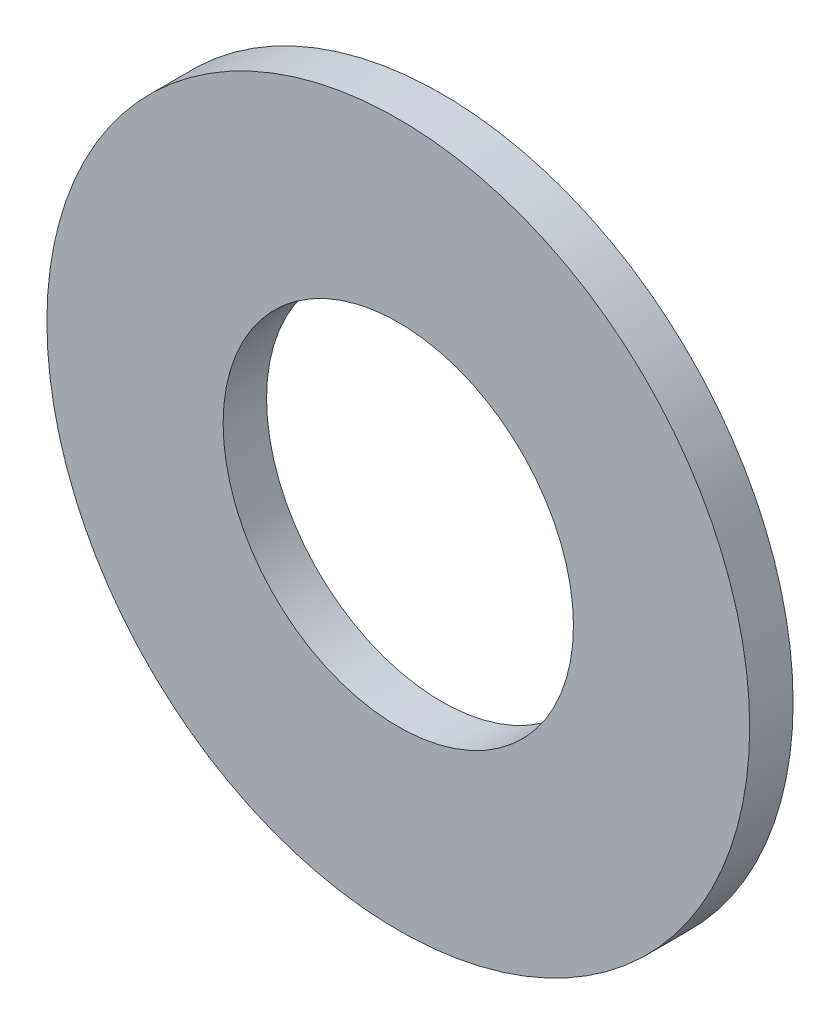
ISO-10303-21;
HEADER;
FILE_DESCRIPTION(('STEP AP214'),'2;1');
FILE_NAME('part.step','',(''),(''),'','','');
FILE_SCHEMA(('AUTOMOTIVE_DESIGN { 1 0 10303 214 1 1 1 1 }'));
ENDSEC;
DATA;
#1=APPLICATION_CONTEXT('core data for automotive mechanical design processes');
#2=APPLICATION_PROTOCOL_DEFINITION('international standard','automotive_design',2000,#1);
#3=PRODUCT_CONTEXT('',#1,'mechanical');
#4=PRODUCT('Part','Part','',(#3));
#5=PRODUCT_RELATED_PRODUCT_CATEGORY('part','',(#4));
#6=PRODUCT_DEFINITION_FORMATION('','',#4);
#7=PRODUCT_DEFINITION_CONTEXT('part definition',#1,'design');
#8=PRODUCT_DEFINITION('design','',#6,#7);
#9=PRODUCT_DEFINITION_SHAPE('','',#8);
#10=(LENGTH_UNIT() NAMED_UNIT(*) SI_UNIT(.MILLI.,.METRE.));
#11=(NAMED_UNIT(*) PLANE_ANGLE_UNIT() SI_UNIT($,.RADIAN.));
#12=(NAMED_UNIT(*) SI_UNIT($,.STERADIAN.) SOLID_ANGLE_UNIT());
#13=UNCERTAINTY_MEASURE_WITH_UNIT(LENGTH_MEASURE(1.E-05),#10,'distance_accuracy_value','');
#14=(GEOMETRIC_REPRESENTATION_CONTEXT(3) GLOBAL_UNCERTAINTY_ASSIGNED_CONTEXT((#13)) GLOBAL_UNIT_ASSIGNED_CONTEXT((#10,
#11,#12)) REPRESENTATION_CONTEXT('',''));
#15=CARTESIAN_POINT('',(0.,0.,0.));
#16=DIRECTION('',(0.,0.,1.));
#17=DIRECTION('',(1.,0.,0.));
#18=AXIS2_PLACEMENT_3D('',#15,#16,#17);
#19=CARTESIAN_POINT('',(0.,0.,0.787399999999998));
#20=DIRECTION('',(0.,0.,1.));
#21=DIRECTION('',(1.,0.,0.));
#22=AXIS2_PLACEMENT_3D('',#19,#20,#21);
#23=PLANE('',#22);
#24=CARTESIAN_POINT('',(0.,0.,0.787399999999998));
#25=DIRECTION('',(0.,0.,1.));
#26=DIRECTION('',(1.,0.,0.));
#27=AXIS2_PLACEMENT_3D('',#24,#25,#26);
#28=CIRCLE('',#27,12.7381);
#29=CARTESIAN_POINT('',(12.7381,0.,0.787399999999998));
#30=VERTEX_POINT('',#29);
#31=EDGE_CURVE('E10',#30,#30,#28,.T.);
#32=ORIENTED_EDGE('',*,*,#31,.T.);
#33=EDGE_LOOP('',(#32));
#34=FACE_BOUND('',#33,.T.);
#35=CARTESIAN_POINT('',(0.,0.,0.787399999999998));
#36=DIRECTION('',(0.,0.,1.));
#37=DIRECTION('',(1.,0.,0.));
#38=AXIS2_PLACEMENT_3D('',#35,#36,#37);
#39=CIRCLE('',#38,6.35);
#40=CARTESIAN_POINT('',(6.35,0.,0.787399999999998));
#41=VERTEX_POINT('',#40);
#42=EDGE_CURVE('E40',#41,#41,#39,.T.);
#43=ORIENTED_EDGE('',*,*,#42,.F.);
#44=EDGE_LOOP('',(#43));
#45=FACE_BOUND('',#44,.T.);
#46=ADVANCED_FACE('F33',(#34,#45),#23,.T.);
#47=CARTESIAN_POINT('',(0.,0.,0.787399999999998));
#48=DIRECTION('',(0.,0.,-1.));
#49=DIRECTION('',(-1.,0.,0.));
#50=AXIS2_PLACEMENT_3D('',#47,#48,#49);
#51=CYLINDRICAL_SURFACE('',#50,12.7381);
#52=ORIENTED_EDGE('',*,*,#31,.F.);
#53=EDGE_LOOP('',(#52));
#54=FACE_BOUND('',#53,.T.);
#55=CARTESIAN_POINT('',(0.,0.,-0.787400000000002));
#56=DIRECTION('',(0.,0.,1.));
#57=DIRECTION('',(1.,0.,0.));
#58=AXIS2_PLACEMENT_3D('',#55,#56,#57);
#59=CIRCLE('',#58,12.7381);
#60=CARTESIAN_POINT('',(12.7381,0.,-0.787400000000002));
#61=VERTEX_POINT('',#60);
#62=EDGE_CURVE('E44',#61,#61,#59,.T.);
#63=ORIENTED_EDGE('',*,*,#62,.T.);
#64=EDGE_LOOP('',(#63));
#65=FACE_BOUND('',#64,.T.);
#66=ADVANCED_FACE('F35',(#54,#65),#51,.T.);
#67=CARTESIAN_POINT('',(0.,0.,0.787399999999998));
#68=DIRECTION('',(0.,0.,-1.));
#69=DIRECTION('',(-1.,0.,0.));
#70=AXIS2_PLACEMENT_3D('',#67,#68,#69);
#71=CYLINDRICAL_SURFACE('',#70,6.35);
#72=ORIENTED_EDGE('',*,*,#42,.T.);
#73=EDGE_LOOP('',(#72));
#74=FACE_BOUND('',#73,.T.);
#75=CARTESIAN_POINT('',(0.,0.,-0.787400000000002));
#76=DIRECTION('',(0.,0.,1.));
#77=DIRECTION('',(1.,0.,0.));
#78=AXIS2_PLACEMENT_3D('',#75,#76,#77);
#79=CIRCLE('',#78,6.35);
#80=CARTESIAN_POINT('',(6.35,0.,-0.787400000000002));
#81=VERTEX_POINT('',#80);
#82=EDGE_CURVE('E48',#81,#81,#79,.T.);
#83=ORIENTED_EDGE('',*,*,#82,.F.);
#84=EDGE_LOOP('',(#83));
#85=FACE_BOUND('',#84,.T.);
#86=ADVANCED_FACE('F57',(#74,#85),#71,.F.);
#87=CARTESIAN_POINT('',(0.,0.,-0.787400000000002));
#88=DIRECTION('',(0.,0.,1.));
#89=DIRECTION('',(1.,0.,0.));
#90=AXIS2_PLACEMENT_3D('',#87,#88,#89);
#91=PLANE('',#90);
#92=ORIENTED_EDGE('',*,*,#82,.T.);
#93=EDGE_LOOP('',(#92));
#94=FACE_BOUND('',#93,.T.);
#95=ORIENTED_EDGE('',*,*,#62,.F.);
#96=EDGE_LOOP('',(#95));
#97=FACE_BOUND('',#96,.T.);
#98=ADVANCED_FACE('F54',(#94,#97),#91,.F.);
#99=CLOSED_SHELL('',(#46,#66,#86,#98));
#100=MANIFOLD_SOLID_BREP('B2',#99);
#101=ADVANCED_BREP_SHAPE_REPRESENTATION('',(#18,#100),#14);
#102=SHAPE_DEFINITION_REPRESENTATION(#9,#101);
ENDSEC;
END-ISO-10303-21;
